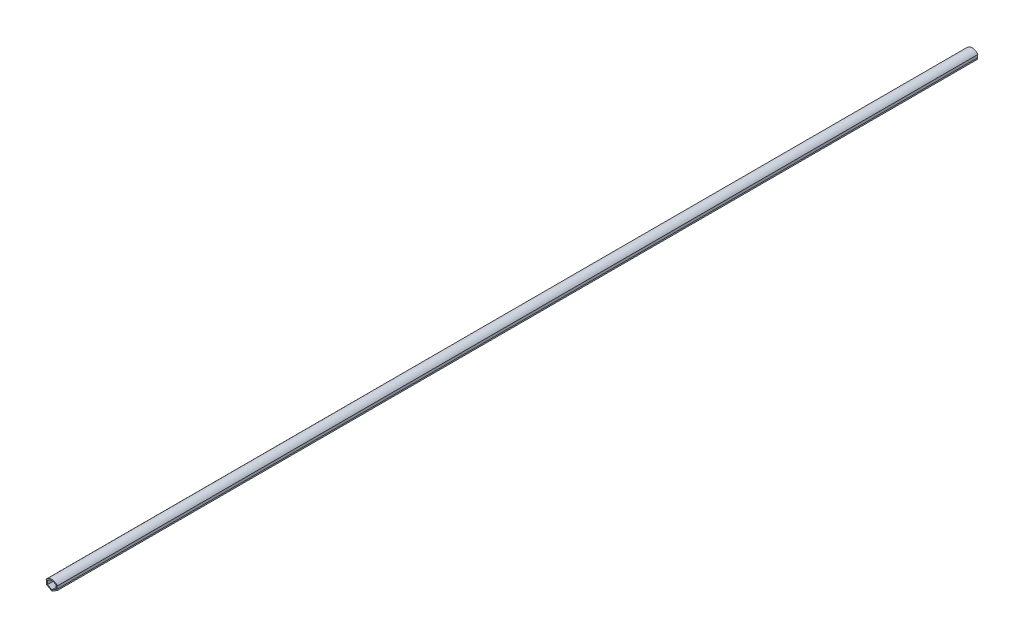
ISO-10303-21;
HEADER;
FILE_DESCRIPTION(('STEP AP214'),'2;1');
FILE_NAME('part.step','',(''),(''),'','','');
FILE_SCHEMA(('AUTOMOTIVE_DESIGN { 1 0 10303 214 1 1 1 1 }'));
ENDSEC;
DATA;
#1=APPLICATION_CONTEXT('core data for automotive mechanical design processes');
#2=APPLICATION_PROTOCOL_DEFINITION('international standard','automotive_design',2000,#1);
#3=PRODUCT_CONTEXT('',#1,'mechanical');
#4=PRODUCT('Part','Part','',(#3));
#5=PRODUCT_RELATED_PRODUCT_CATEGORY('part','',(#4));
#6=PRODUCT_DEFINITION_FORMATION('','',#4);
#7=PRODUCT_DEFINITION_CONTEXT('part definition',#1,'design');
#8=PRODUCT_DEFINITION('design','',#6,#7);
#9=PRODUCT_DEFINITION_SHAPE('','',#8);
#10=(LENGTH_UNIT() NAMED_UNIT(*) SI_UNIT(.MILLI.,.METRE.));
#11=(NAMED_UNIT(*) PLANE_ANGLE_UNIT() SI_UNIT($,.RADIAN.));
#12=(NAMED_UNIT(*) SI_UNIT($,.STERADIAN.) SOLID_ANGLE_UNIT());
#13=UNCERTAINTY_MEASURE_WITH_UNIT(LENGTH_MEASURE(1.E-05),#10,'distance_accuracy_value','');
#14=(GEOMETRIC_REPRESENTATION_CONTEXT(3) GLOBAL_UNCERTAINTY_ASSIGNED_CONTEXT((#13)) GLOBAL_UNIT_ASSIGNED_CONTEXT((#10,
#11,#12)) REPRESENTATION_CONTEXT('',''));
#15=CARTESIAN_POINT('',(0.,0.,0.));
#16=DIRECTION('',(0.,0.,1.));
#17=DIRECTION('',(1.,0.,0.));
#18=AXIS2_PLACEMENT_3D('',#15,#16,#17);
#19=CARTESIAN_POINT('',(0.,0.,1000.));
#20=DIRECTION('',(-0.499999999999998,-0.86602540378444,0.));
#21=DIRECTION('',(0.86602540378444,-0.499999999999998,0.));
#22=AXIS2_PLACEMENT_3D('',#19,#20,#21);
#23=PLANE('',#22);
#24=DIRECTION('',(-0.86602540378444,0.499999999999998,0.));
#25=VECTOR('',#24,1.);
#26=CARTESIAN_POINT('',(0.,0.,0.));
#27=LINE('',#26,#25);
#28=CARTESIAN_POINT('',(0.,0.,0.));
#29=VERTEX_POINT('',#28);
#30=CARTESIAN_POINT('',(-6.1,3.52183664205669,0.));
#31=VERTEX_POINT('',#30);
#32=EDGE_CURVE('E186',#29,#31,#27,.T.);
#33=ORIENTED_EDGE('',*,*,#32,.F.);
#34=DIRECTION('',(0.,0.,-1.));
#35=VECTOR('',#34,1.);
#36=CARTESIAN_POINT('',(0.,0.,1000.));
#37=LINE('',#36,#35);
#38=CARTESIAN_POINT('',(0.,0.,1000.));
#39=VERTEX_POINT('',#38);
#40=EDGE_CURVE('E11',#39,#29,#37,.T.);
#41=ORIENTED_EDGE('',*,*,#40,.F.);
#42=DIRECTION('',(-0.86602540378444,0.499999999999998,0.));
#43=VECTOR('',#42,1.);
#44=CARTESIAN_POINT('',(0.,0.,1000.));
#45=LINE('',#44,#43);
#46=CARTESIAN_POINT('',(-6.1,3.52183664205669,1000.));
#47=VERTEX_POINT('',#46);
#48=EDGE_CURVE('E264',#39,#47,#45,.T.);
#49=ORIENTED_EDGE('',*,*,#48,.T.);
#50=DIRECTION('',(0.,0.,-1.));
#51=VECTOR('',#50,1.);
#52=CARTESIAN_POINT('',(-6.1,3.52183664205669,1000.));
#53=LINE('',#52,#51);
#54=EDGE_CURVE('E56',#47,#31,#53,.T.);
#55=ORIENTED_EDGE('',*,*,#54,.T.);
#56=EDGE_LOOP('',(#33,#41,#49,#55));
#57=FACE_BOUND('',#56,.T.);
#58=ADVANCED_FACE('F37',(#57),#23,.T.);
#59=CARTESIAN_POINT('',(0.,0.,1000.));
#60=DIRECTION('',(-0.499999999999998,0.86602540378444,0.));
#61=DIRECTION('',(-0.86602540378444,-0.499999999999998,0.));
#62=AXIS2_PLACEMENT_3D('',#59,#60,#61);
#63=PLANE('',#62);
#64=DIRECTION('',(0.86602540378444,0.499999999999998,0.));
#65=VECTOR('',#64,1.);
#66=CARTESIAN_POINT('',(0.,0.,0.));
#67=LINE('',#66,#65);
#68=CARTESIAN_POINT('',(6.1,3.52183664205669,0.));
#69=VERTEX_POINT('',#68);
#70=EDGE_CURVE('E188',#29,#69,#67,.T.);
#71=ORIENTED_EDGE('',*,*,#70,.T.);
#72=DIRECTION('',(0.,0.,-1.));
#73=VECTOR('',#72,1.);
#74=CARTESIAN_POINT('',(6.1,3.52183664205669,1000.));
#75=LINE('',#74,#73);
#76=CARTESIAN_POINT('',(6.1,3.52183664205669,1000.));
#77=VERTEX_POINT('',#76);
#78=EDGE_CURVE('E47',#77,#69,#75,.T.);
#79=ORIENTED_EDGE('',*,*,#78,.F.);
#80=DIRECTION('',(0.86602540378444,0.499999999999998,0.));
#81=VECTOR('',#80,1.);
#82=CARTESIAN_POINT('',(0.,0.,1000.));
#83=LINE('',#82,#81);
#84=EDGE_CURVE('E266',#39,#77,#83,.T.);
#85=ORIENTED_EDGE('',*,*,#84,.F.);
#86=ORIENTED_EDGE('',*,*,#40,.T.);
#87=EDGE_LOOP('',(#71,#79,#85,#86));
#88=FACE_BOUND('',#87,.T.);
#89=ADVANCED_FACE('F293',(#88),#63,.F.);
#90=CARTESIAN_POINT('',(6.1,3.5218366420567,1000.));
#91=DIRECTION('',(-0.86602540378444,-0.499999999999998,0.));
#92=DIRECTION('',(0.499999999999998,-0.86602540378444,0.));
#93=AXIS2_PLACEMENT_3D('',#90,#91,#92);
#94=PLANE('',#93);
#95=DIRECTION('',(-0.499999999999998,0.86602540378444,0.));
#96=VECTOR('',#95,1.);
#97=CARTESIAN_POINT('',(6.1,3.5218366420567,0.));
#98=LINE('',#97,#96);
#99=CARTESIAN_POINT('',(5.6,4.38786204584113,0.));
#100=VERTEX_POINT('',#99);
#101=EDGE_CURVE('E191',#69,#100,#98,.T.);
#102=ORIENTED_EDGE('',*,*,#101,.T.);
#103=DIRECTION('',(0.,0.,-1.));
#104=VECTOR('',#103,1.);
#105=CARTESIAN_POINT('',(5.6,4.38786204584113,1000.));
#106=LINE('',#105,#104);
#107=CARTESIAN_POINT('',(5.6,4.38786204584113,1000.));
#108=VERTEX_POINT('',#107);
#109=EDGE_CURVE('E218',#108,#100,#106,.T.);
#110=ORIENTED_EDGE('',*,*,#109,.F.);
#111=DIRECTION('',(-0.499999999999998,0.86602540378444,0.));
#112=VECTOR('',#111,1.);
#113=CARTESIAN_POINT('',(6.1,3.5218366420567,1000.));
#114=LINE('',#113,#112);
#115=EDGE_CURVE('E269',#77,#108,#114,.T.);
#116=ORIENTED_EDGE('',*,*,#115,.F.);
#117=ORIENTED_EDGE('',*,*,#78,.T.);
#118=EDGE_LOOP('',(#102,#110,#116,#117));
#119=FACE_BOUND('',#118,.T.);
#120=ADVANCED_FACE('F298',(#119),#94,.F.);
#121=CARTESIAN_POINT('',(5.6,0.,1000.));
#122=DIRECTION('',(-1.,0.,0.));
#123=DIRECTION('',(0.,0.,1.));
#124=AXIS2_PLACEMENT_3D('',#121,#122,#123);
#125=PLANE('',#124);
#126=DIRECTION('',(0.,1.,0.));
#127=VECTOR('',#126,1.);
#128=CARTESIAN_POINT('',(5.6,0.,0.));
#129=LINE('',#128,#127);
#130=CARTESIAN_POINT('',(5.6,8.00799361021956,0.));
#131=VERTEX_POINT('',#130);
#132=EDGE_CURVE('E194',#100,#131,#129,.T.);
#133=ORIENTED_EDGE('',*,*,#132,.T.);
#134=DIRECTION('',(0.,0.,-1.));
#135=VECTOR('',#134,1.);
#136=CARTESIAN_POINT('',(5.6,8.00799361021956,1000.));
#137=LINE('',#136,#135);
#138=CARTESIAN_POINT('',(5.6,8.00799361021956,1000.));
#139=VERTEX_POINT('',#138);
#140=EDGE_CURVE('E215',#139,#131,#137,.T.);
#141=ORIENTED_EDGE('',*,*,#140,.F.);
#142=DIRECTION('',(0.,1.,0.));
#143=VECTOR('',#142,1.);
#144=CARTESIAN_POINT('',(5.6,0.,1000.));
#145=LINE('',#144,#143);
#146=EDGE_CURVE('E272',#108,#139,#145,.T.);
#147=ORIENTED_EDGE('',*,*,#146,.F.);
#148=ORIENTED_EDGE('',*,*,#109,.T.);
#149=EDGE_LOOP('',(#133,#141,#147,#148));
#150=FACE_BOUND('',#149,.T.);
#151=ADVANCED_FACE('F323',(#150),#125,.F.);
#152=CARTESIAN_POINT('',(0.,8.00799361021958,1000.));
#153=DIRECTION('',(0.,1.,0.));
#154=DIRECTION('',(-1.,0.,0.));
#155=AXIS2_PLACEMENT_3D('',#152,#153,#154);
#156=PLANE('',#155);
#157=DIRECTION('',(1.,0.,0.));
#158=VECTOR('',#157,1.);
#159=CARTESIAN_POINT('',(0.,8.00799361021958,0.));
#160=LINE('',#159,#158);
#161=CARTESIAN_POINT('',(6.23858958419289,8.00799361021956,0.));
#162=VERTEX_POINT('',#161);
#163=EDGE_CURVE('E197',#131,#162,#160,.T.);
#164=ORIENTED_EDGE('',*,*,#163,.T.);
#165=DIRECTION('',(0.,0.,-1.));
#166=VECTOR('',#165,1.);
#167=CARTESIAN_POINT('',(6.23858958419289,8.00799361021956,1000.));
#168=LINE('',#167,#166);
#169=CARTESIAN_POINT('',(6.23858958419289,8.00799361021956,1000.));
#170=VERTEX_POINT('',#169);
#171=EDGE_CURVE('E213',#170,#162,#168,.T.);
#172=ORIENTED_EDGE('',*,*,#171,.F.);
#173=DIRECTION('',(1.,0.,0.));
#174=VECTOR('',#173,1.);
#175=CARTESIAN_POINT('',(0.,8.00799361021958,1000.));
#176=LINE('',#175,#174);
#177=EDGE_CURVE('E275',#139,#170,#176,.T.);
#178=ORIENTED_EDGE('',*,*,#177,.F.);
#179=ORIENTED_EDGE('',*,*,#140,.T.);
#180=EDGE_LOOP('',(#164,#172,#178,#179));
#181=FACE_BOUND('',#180,.T.);
#182=ADVANCED_FACE('F320',(#181),#156,.F.);
#183=CARTESIAN_POINT('',(0.,3.,1000.));
#184=DIRECTION('',(0.,0.,-1.));
#185=DIRECTION('',(-1.,0.,0.));
#186=AXIS2_PLACEMENT_3D('',#183,#184,#185);
#187=CYLINDRICAL_SURFACE('',#186,8.);
#188=CARTESIAN_POINT('',(0.,3.,0.));
#189=DIRECTION('',(0.,0.,1.));
#190=DIRECTION('',(1.,0.,0.));
#191=AXIS2_PLACEMENT_3D('',#188,#189,#190);
#192=CIRCLE('',#191,8.);
#193=CARTESIAN_POINT('',(-6.23858958419289,8.00799361021956,0.));
#194=VERTEX_POINT('',#193);
#195=EDGE_CURVE('E200',#194,#162,#192,.F.);
#196=ORIENTED_EDGE('',*,*,#195,.F.);
#197=DIRECTION('',(0.,0.,-1.));
#198=VECTOR('',#197,1.);
#199=CARTESIAN_POINT('',(-6.23858958419289,8.00799361021956,1000.));
#200=LINE('',#199,#198);
#201=CARTESIAN_POINT('',(-6.23858958419289,8.00799361021956,1000.));
#202=VERTEX_POINT('',#201);
#203=EDGE_CURVE('E154',#202,#194,#200,.T.);
#204=ORIENTED_EDGE('',*,*,#203,.F.);
#205=CARTESIAN_POINT('',(0.,3.,1000.));
#206=DIRECTION('',(0.,0.,1.));
#207=DIRECTION('',(1.,0.,0.));
#208=AXIS2_PLACEMENT_3D('',#205,#206,#207);
#209=CIRCLE('',#208,8.);
#210=EDGE_CURVE('E164',#202,#170,#209,.F.);
#211=ORIENTED_EDGE('',*,*,#210,.T.);
#212=ORIENTED_EDGE('',*,*,#171,.T.);
#213=EDGE_LOOP('',(#196,#204,#211,#212));
#214=FACE_BOUND('',#213,.T.);
#215=ADVANCED_FACE('F278',(#214),#187,.T.);
#216=CARTESIAN_POINT('',(0.,8.00799361021958,1000.));
#217=DIRECTION('',(0.,-1.,0.));
#218=DIRECTION('',(1.,0.,0.));
#219=AXIS2_PLACEMENT_3D('',#216,#217,#218);
#220=PLANE('',#219);
#221=DIRECTION('',(-1.,0.,0.));
#222=VECTOR('',#221,1.);
#223=CARTESIAN_POINT('',(0.,8.00799361021958,0.));
#224=LINE('',#223,#222);
#225=CARTESIAN_POINT('',(-5.6,8.00799361021956,0.));
#226=VERTEX_POINT('',#225);
#227=EDGE_CURVE('E150',#226,#194,#224,.T.);
#228=ORIENTED_EDGE('',*,*,#227,.F.);
#229=DIRECTION('',(0.,0.,-1.));
#230=VECTOR('',#229,1.);
#231=CARTESIAN_POINT('',(-5.6,8.00799361021956,1000.));
#232=LINE('',#231,#230);
#233=CARTESIAN_POINT('',(-5.6,8.00799361021956,1000.));
#234=VERTEX_POINT('',#233);
#235=EDGE_CURVE('E145',#234,#226,#232,.T.);
#236=ORIENTED_EDGE('',*,*,#235,.F.);
#237=DIRECTION('',(-1.,0.,0.));
#238=VECTOR('',#237,1.);
#239=CARTESIAN_POINT('',(0.,8.00799361021958,1000.));
#240=LINE('',#239,#238);
#241=EDGE_CURVE('E148',#234,#202,#240,.T.);
#242=ORIENTED_EDGE('',*,*,#241,.T.);
#243=ORIENTED_EDGE('',*,*,#203,.T.);
#244=EDGE_LOOP('',(#228,#236,#242,#243));
#245=FACE_BOUND('',#244,.T.);
#246=ADVANCED_FACE('F147',(#245),#220,.T.);
#247=CARTESIAN_POINT('',(-5.6,0.,1000.));
#248=DIRECTION('',(-1.,0.,0.));
#249=DIRECTION('',(0.,0.,1.));
#250=AXIS2_PLACEMENT_3D('',#247,#248,#249);
#251=PLANE('',#250);
#252=DIRECTION('',(0.,1.,0.));
#253=VECTOR('',#252,1.);
#254=CARTESIAN_POINT('',(-5.6,0.,0.));
#255=LINE('',#254,#253);
#256=CARTESIAN_POINT('',(-5.6,4.38786204584113,0.));
#257=VERTEX_POINT('',#256);
#258=EDGE_CURVE('E204',#257,#226,#255,.T.);
#259=ORIENTED_EDGE('',*,*,#258,.F.);
#260=DIRECTION('',(0.,0.,-1.));
#261=VECTOR('',#260,1.);
#262=CARTESIAN_POINT('',(-5.6,4.38786204584113,1000.));
#263=LINE('',#262,#261);
#264=CARTESIAN_POINT('',(-5.6,4.38786204584113,1000.));
#265=VERTEX_POINT('',#264);
#266=EDGE_CURVE('E99',#265,#257,#263,.T.);
#267=ORIENTED_EDGE('',*,*,#266,.F.);
#268=DIRECTION('',(0.,1.,0.));
#269=VECTOR('',#268,1.);
#270=CARTESIAN_POINT('',(-5.6,0.,1000.));
#271=LINE('',#270,#269);
#272=EDGE_CURVE('E162',#265,#234,#271,.T.);
#273=ORIENTED_EDGE('',*,*,#272,.T.);
#274=ORIENTED_EDGE('',*,*,#235,.T.);
#275=EDGE_LOOP('',(#259,#267,#273,#274));
#276=FACE_BOUND('',#275,.T.);
#277=ADVANCED_FACE('F166',(#276),#251,.T.);
#278=CARTESIAN_POINT('',(-0.499999999999998,0.86602540378444,1000.));
#279=DIRECTION('',(-0.499999999999998,0.86602540378444,0.));
#280=DIRECTION('',(-0.86602540378444,-0.499999999999998,0.));
#281=AXIS2_PLACEMENT_3D('',#278,#279,#280);
#282=PLANE('',#281);
#283=DIRECTION('',(0.86602540378444,0.499999999999998,0.));
#284=VECTOR('',#283,1.);
#285=CARTESIAN_POINT('',(-0.499999999999998,0.86602540378444,0.));
#286=LINE('',#285,#284);
#287=CARTESIAN_POINT('',(0.,1.15470053837925,0.));
#288=VERTEX_POINT('',#287);
#289=CARTESIAN_POINT('',(4.6,3.81051177665151,0.));
#290=VERTEX_POINT('',#289);
#291=EDGE_CURVE('E173',#288,#290,#286,.T.);
#292=ORIENTED_EDGE('',*,*,#291,.F.);
#293=DIRECTION('',(0.,0.,-1.));
#294=VECTOR('',#293,1.);
#295=CARTESIAN_POINT('',(0.,1.15470053837925,1000.));
#296=LINE('',#295,#294);
#297=CARTESIAN_POINT('',(0.,1.15470053837925,1000.));
#298=VERTEX_POINT('',#297);
#299=EDGE_CURVE('E41',#298,#288,#296,.T.);
#300=ORIENTED_EDGE('',*,*,#299,.F.);
#301=DIRECTION('',(0.86602540378444,0.499999999999998,0.));
#302=VECTOR('',#301,1.);
#303=CARTESIAN_POINT('',(-0.499999999999998,0.86602540378444,1000.));
#304=LINE('',#303,#302);
#305=CARTESIAN_POINT('',(4.6,3.81051177665151,1000.));
#306=VERTEX_POINT('',#305);
#307=EDGE_CURVE('E209',#298,#306,#304,.T.);
#308=ORIENTED_EDGE('',*,*,#307,.T.);
#309=DIRECTION('',(0.,0.,-1.));
#310=VECTOR('',#309,1.);
#311=CARTESIAN_POINT('',(4.6,3.81051177665151,1000.));
#312=LINE('',#311,#310);
#313=EDGE_CURVE('E169',#306,#290,#312,.T.);
#314=ORIENTED_EDGE('',*,*,#313,.T.);
#315=EDGE_LOOP('',(#292,#300,#308,#314));
#316=FACE_BOUND('',#315,.T.);
#317=ADVANCED_FACE('F39',(#316),#282,.T.);
#318=CARTESIAN_POINT('',(0.499999999999998,0.86602540378444,1000.));
#319=DIRECTION('',(-0.499999999999998,-0.86602540378444,0.));
#320=DIRECTION('',(0.86602540378444,-0.499999999999998,0.));
#321=AXIS2_PLACEMENT_3D('',#318,#319,#320);
#322=PLANE('',#321);
#323=DIRECTION('',(-0.86602540378444,0.499999999999998,0.));
#324=VECTOR('',#323,1.);
#325=CARTESIAN_POINT('',(0.499999999999998,0.86602540378444,0.));
#326=LINE('',#325,#324);
#327=CARTESIAN_POINT('',(-4.6,3.81051177665151,0.));
#328=VERTEX_POINT('',#327);
#329=EDGE_CURVE('E176',#288,#328,#326,.T.);
#330=ORIENTED_EDGE('',*,*,#329,.T.);
#331=DIRECTION('',(0.,0.,-1.));
#332=VECTOR('',#331,1.);
#333=CARTESIAN_POINT('',(-4.6,3.81051177665151,1000.));
#334=LINE('',#333,#332);
#335=CARTESIAN_POINT('',(-4.6,3.81051177665151,1000.));
#336=VERTEX_POINT('',#335);
#337=EDGE_CURVE('E228',#336,#328,#334,.T.);
#338=ORIENTED_EDGE('',*,*,#337,.F.);
#339=DIRECTION('',(-0.86602540378444,0.499999999999998,0.));
#340=VECTOR('',#339,1.);
#341=CARTESIAN_POINT('',(0.499999999999998,0.86602540378444,1000.));
#342=LINE('',#341,#340);
#343=EDGE_CURVE('E237',#298,#336,#342,.T.);
#344=ORIENTED_EDGE('',*,*,#343,.F.);
#345=ORIENTED_EDGE('',*,*,#299,.T.);
#346=EDGE_LOOP('',(#330,#338,#344,#345));
#347=FACE_BOUND('',#346,.T.);
#348=ADVANCED_FACE('F236',(#347),#322,.F.);
#349=CARTESIAN_POINT('',(-4.6,0.,1000.));
#350=DIRECTION('',(-1.,0.,0.));
#351=DIRECTION('',(0.,0.,1.));
#352=AXIS2_PLACEMENT_3D('',#349,#350,#351);
#353=PLANE('',#352);
#354=DIRECTION('',(0.,1.,0.));
#355=VECTOR('',#354,1.);
#356=CARTESIAN_POINT('',(-4.6,0.,0.));
#357=LINE('',#356,#355);
#358=CARTESIAN_POINT('',(-4.6,8.00799361021956,0.));
#359=VERTEX_POINT('',#358);
#360=EDGE_CURVE('E178',#328,#359,#357,.T.);
#361=ORIENTED_EDGE('',*,*,#360,.T.);
#362=DIRECTION('',(0.,0.,-1.));
#363=VECTOR('',#362,1.);
#364=CARTESIAN_POINT('',(-4.6,8.00799361021956,1000.));
#365=LINE('',#364,#363);
#366=CARTESIAN_POINT('',(-4.6,8.00799361021956,1000.));
#367=VERTEX_POINT('',#366);
#368=EDGE_CURVE('E226',#367,#359,#365,.T.);
#369=ORIENTED_EDGE('',*,*,#368,.F.);
#370=DIRECTION('',(0.,1.,0.));
#371=VECTOR('',#370,1.);
#372=CARTESIAN_POINT('',(-4.6,0.,1000.));
#373=LINE('',#372,#371);
#374=EDGE_CURVE('E256',#336,#367,#373,.T.);
#375=ORIENTED_EDGE('',*,*,#374,.F.);
#376=ORIENTED_EDGE('',*,*,#337,.T.);
#377=EDGE_LOOP('',(#361,#369,#375,#376));
#378=FACE_BOUND('',#377,.T.);
#379=ADVANCED_FACE('F255',(#378),#353,.F.);
#380=CARTESIAN_POINT('',(0.,3.,1000.));
#381=DIRECTION('',(0.,0.,-1.));
#382=DIRECTION('',(-1.,0.,0.));
#383=AXIS2_PLACEMENT_3D('',#380,#381,#382);
#384=CYLINDRICAL_SURFACE('',#383,6.8);
#385=CARTESIAN_POINT('',(0.,3.,0.));
#386=DIRECTION('',(0.,0.,1.));
#387=DIRECTION('',(1.,0.,0.));
#388=AXIS2_PLACEMENT_3D('',#385,#386,#387);
#389=CIRCLE('',#388,6.8);
#390=CARTESIAN_POINT('',(4.6,8.00799361021956,0.));
#391=VERTEX_POINT('',#390);
#392=EDGE_CURVE('E180',#359,#391,#389,.F.);
#393=ORIENTED_EDGE('',*,*,#392,.T.);
#394=DIRECTION('',(0.,0.,-1.));
#395=VECTOR('',#394,1.);
#396=CARTESIAN_POINT('',(4.6,8.00799361021956,1000.));
#397=LINE('',#396,#395);
#398=CARTESIAN_POINT('',(4.6,8.00799361021956,1000.));
#399=VERTEX_POINT('',#398);
#400=EDGE_CURVE('E224',#399,#391,#397,.T.);
#401=ORIENTED_EDGE('',*,*,#400,.F.);
#402=CARTESIAN_POINT('',(0.,3.,1000.));
#403=DIRECTION('',(0.,0.,1.));
#404=DIRECTION('',(1.,0.,0.));
#405=AXIS2_PLACEMENT_3D('',#402,#403,#404);
#406=CIRCLE('',#405,6.8);
#407=EDGE_CURVE('E254',#367,#399,#406,.F.);
#408=ORIENTED_EDGE('',*,*,#407,.F.);
#409=ORIENTED_EDGE('',*,*,#368,.T.);
#410=EDGE_LOOP('',(#393,#401,#408,#409));
#411=FACE_BOUND('',#410,.T.);
#412=ADVANCED_FACE('F251',(#411),#384,.F.);
#413=CARTESIAN_POINT('',(4.6,0.,1000.));
#414=DIRECTION('',(-1.,0.,0.));
#415=DIRECTION('',(0.,0.,1.));
#416=AXIS2_PLACEMENT_3D('',#413,#414,#415);
#417=PLANE('',#416);
#418=DIRECTION('',(0.,1.,0.));
#419=VECTOR('',#418,1.);
#420=CARTESIAN_POINT('',(4.6,0.,0.));
#421=LINE('',#420,#419);
#422=EDGE_CURVE('E183',#290,#391,#421,.T.);
#423=ORIENTED_EDGE('',*,*,#422,.F.);
#424=ORIENTED_EDGE('',*,*,#313,.F.);
#425=DIRECTION('',(0.,1.,0.));
#426=VECTOR('',#425,1.);
#427=CARTESIAN_POINT('',(4.6,0.,1000.));
#428=LINE('',#427,#426);
#429=EDGE_CURVE('E248',#306,#399,#428,.T.);
#430=ORIENTED_EDGE('',*,*,#429,.T.);
#431=ORIENTED_EDGE('',*,*,#400,.T.);
#432=EDGE_LOOP('',(#423,#424,#430,#431));
#433=FACE_BOUND('',#432,.T.);
#434=ADVANCED_FACE('F247',(#433),#417,.T.);
#435=CARTESIAN_POINT('',(-6.1,3.52183664205669,1000.));
#436=DIRECTION('',(-0.86602540378444,0.499999999999998,0.));
#437=DIRECTION('',(-0.499999999999998,-0.86602540378444,0.));
#438=AXIS2_PLACEMENT_3D('',#435,#436,#437);
#439=PLANE('',#438);
#440=DIRECTION('',(0.499999999999998,0.86602540378444,0.));
#441=VECTOR('',#440,1.);
#442=CARTESIAN_POINT('',(-6.1,3.52183664205669,0.));
#443=LINE('',#442,#441);
#444=EDGE_CURVE('E206',#31,#257,#443,.T.);
#445=ORIENTED_EDGE('',*,*,#444,.F.);
#446=ORIENTED_EDGE('',*,*,#54,.F.);
#447=DIRECTION('',(0.499999999999998,0.86602540378444,0.));
#448=VECTOR('',#447,1.);
#449=CARTESIAN_POINT('',(-6.1,3.52183664205669,1000.));
#450=LINE('',#449,#448);
#451=EDGE_CURVE('E167',#47,#265,#450,.T.);
#452=ORIENTED_EDGE('',*,*,#451,.T.);
#453=ORIENTED_EDGE('',*,*,#266,.T.);
#454=EDGE_LOOP('',(#445,#446,#452,#453));
#455=FACE_BOUND('',#454,.T.);
#456=ADVANCED_FACE('F281',(#455),#439,.T.);
#457=CARTESIAN_POINT('',(0.,0.,1000.));
#458=DIRECTION('',(0.,0.,1.));
#459=DIRECTION('',(1.,0.,0.));
#460=AXIS2_PLACEMENT_3D('',#457,#458,#459);
#461=PLANE('',#460);
#462=ORIENTED_EDGE('',*,*,#307,.F.);
#463=ORIENTED_EDGE('',*,*,#343,.T.);
#464=ORIENTED_EDGE('',*,*,#374,.T.);
#465=ORIENTED_EDGE('',*,*,#407,.T.);
#466=ORIENTED_EDGE('',*,*,#429,.F.);
#467=EDGE_LOOP('',(#462,#463,#464,#465,#466));
#468=FACE_BOUND('',#467,.T.);
#469=ORIENTED_EDGE('',*,*,#48,.F.);
#470=ORIENTED_EDGE('',*,*,#84,.T.);
#471=ORIENTED_EDGE('',*,*,#115,.T.);
#472=ORIENTED_EDGE('',*,*,#146,.T.);
#473=ORIENTED_EDGE('',*,*,#177,.T.);
#474=ORIENTED_EDGE('',*,*,#210,.F.);
#475=ORIENTED_EDGE('',*,*,#241,.F.);
#476=ORIENTED_EDGE('',*,*,#272,.F.);
#477=ORIENTED_EDGE('',*,*,#451,.F.);
#478=EDGE_LOOP('',(#469,#470,#471,#472,#473,#474,#475,#476,#477));
#479=FACE_BOUND('',#478,.T.);
#480=ADVANCED_FACE('F160',(#468,#479),#461,.T.);
#481=CARTESIAN_POINT('',(0.,0.,0.));
#482=DIRECTION('',(0.,0.,1.));
#483=DIRECTION('',(1.,0.,0.));
#484=AXIS2_PLACEMENT_3D('',#481,#482,#483);
#485=PLANE('',#484);
#486=ORIENTED_EDGE('',*,*,#291,.T.);
#487=ORIENTED_EDGE('',*,*,#422,.T.);
#488=ORIENTED_EDGE('',*,*,#392,.F.);
#489=ORIENTED_EDGE('',*,*,#360,.F.);
#490=ORIENTED_EDGE('',*,*,#329,.F.);
#491=EDGE_LOOP('',(#486,#487,#488,#489,#490));
#492=FACE_BOUND('',#491,.T.);
#493=ORIENTED_EDGE('',*,*,#32,.T.);
#494=ORIENTED_EDGE('',*,*,#444,.T.);
#495=ORIENTED_EDGE('',*,*,#258,.T.);
#496=ORIENTED_EDGE('',*,*,#227,.T.);
#497=ORIENTED_EDGE('',*,*,#195,.T.);
#498=ORIENTED_EDGE('',*,*,#163,.F.);
#499=ORIENTED_EDGE('',*,*,#132,.F.);
#500=ORIENTED_EDGE('',*,*,#101,.F.);
#501=ORIENTED_EDGE('',*,*,#70,.F.);
#502=EDGE_LOOP('',(#493,#494,#495,#496,#497,#498,#499,#500,#501));
#503=FACE_BOUND('',#502,.T.);
#504=ADVANCED_FACE('F240',(#492,#503),#485,.F.);
#505=CLOSED_SHELL('',(#58,#89,#120,#151,#182,#215,#246,#277,#317,#348,#379,#412,#434,#456,#480,#504));
#506=MANIFOLD_SOLID_BREP('B2',#505);
#507=ADVANCED_BREP_SHAPE_REPRESENTATION('',(#18,#506),#14);
#508=SHAPE_DEFINITION_REPRESENTATION(#9,#507);
ENDSEC;
END-ISO-10303-21;
